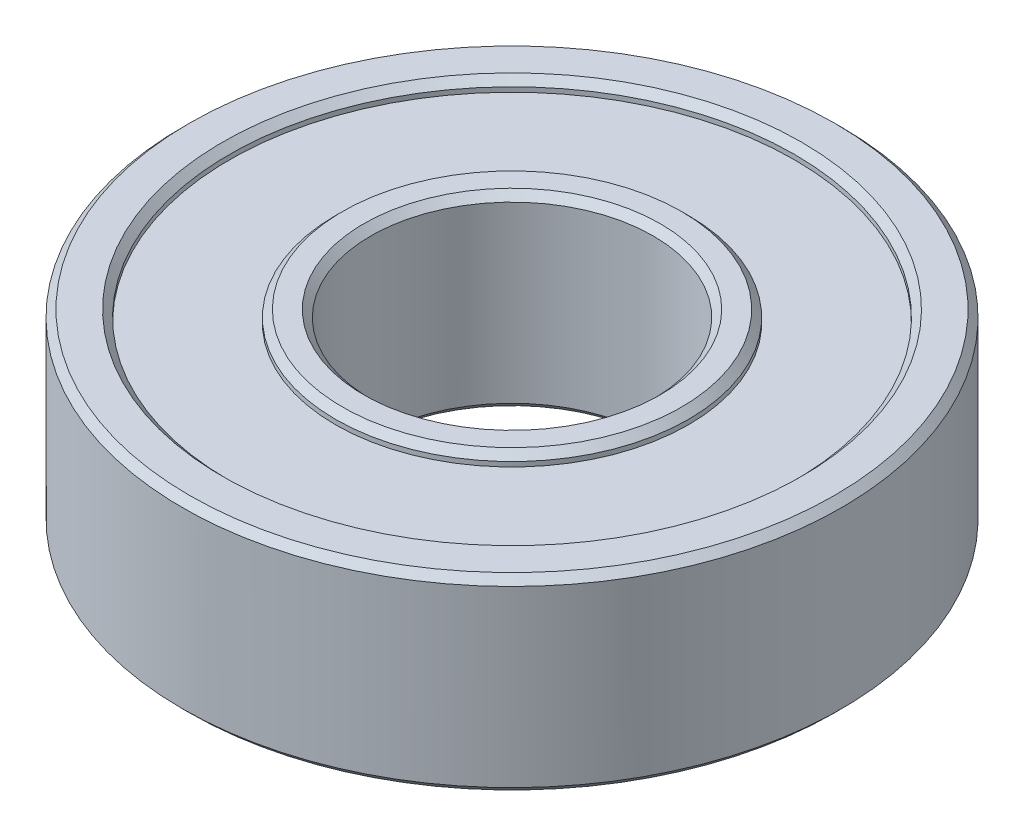
ISO-10303-21;
HEADER;
FILE_DESCRIPTION(('STEP AP214'),'2;1');
FILE_NAME('part.step','',(''),(''),'','','');
FILE_SCHEMA(('AUTOMOTIVE_DESIGN { 1 0 10303 214 1 1 1 1 }'));
ENDSEC;
DATA;
#1=APPLICATION_CONTEXT('core data for automotive mechanical design processes');
#2=APPLICATION_PROTOCOL_DEFINITION('international standard','automotive_design',2000,#1);
#3=PRODUCT_CONTEXT('',#1,'mechanical');
#4=PRODUCT('Part','Part','',(#3));
#5=PRODUCT_RELATED_PRODUCT_CATEGORY('part','',(#4));
#6=PRODUCT_DEFINITION_FORMATION('','',#4);
#7=PRODUCT_DEFINITION_CONTEXT('part definition',#1,'design');
#8=PRODUCT_DEFINITION('design','',#6,#7);
#9=PRODUCT_DEFINITION_SHAPE('','',#8);
#10=(LENGTH_UNIT() NAMED_UNIT(*) SI_UNIT(.MILLI.,.METRE.));
#11=(NAMED_UNIT(*) PLANE_ANGLE_UNIT() SI_UNIT($,.RADIAN.));
#12=(NAMED_UNIT(*) SI_UNIT($,.STERADIAN.) SOLID_ANGLE_UNIT());
#13=UNCERTAINTY_MEASURE_WITH_UNIT(LENGTH_MEASURE(1.E-05),#10,'distance_accuracy_value','');
#14=(GEOMETRIC_REPRESENTATION_CONTEXT(3) GLOBAL_UNCERTAINTY_ASSIGNED_CONTEXT((#13)) GLOBAL_UNIT_ASSIGNED_CONTEXT((#10,
#11,#12)) REPRESENTATION_CONTEXT('',''));
#15=CARTESIAN_POINT('',(0.,0.,0.));
#16=DIRECTION('',(0.,0.,1.));
#17=DIRECTION('',(1.,0.,0.));
#18=AXIS2_PLACEMENT_3D('',#15,#16,#17);
#19=CARTESIAN_POINT('',(-7.5,0.,0.));
#20=DIRECTION('',(0.,1.,0.));
#21=DIRECTION('',(0.,0.,1.));
#22=AXIS2_PLACEMENT_3D('',#19,#20,#21);
#23=PLANE('',#22);
#24=CARTESIAN_POINT('',(0.,0.,0.));
#25=DIRECTION('',(0.,1.,0.));
#26=DIRECTION('',(0.,0.,1.));
#27=AXIS2_PLACEMENT_3D('',#24,#25,#26);
#28=CIRCLE('',#27,6.3);
#29=CARTESIAN_POINT('',(0.,0.,6.3));
#30=VERTEX_POINT('',#29);
#31=EDGE_CURVE('E74',#30,#30,#28,.T.);
#32=ORIENTED_EDGE('',*,*,#31,.T.);
#33=EDGE_LOOP('',(#32));
#34=FACE_BOUND('',#33,.T.);
#35=CARTESIAN_POINT('',(0.,0.,0.));
#36=DIRECTION('',(0.,1.,0.));
#37=DIRECTION('',(0.,0.,1.));
#38=AXIS2_PLACEMENT_3D('',#35,#36,#37);
#39=CIRCLE('',#38,7.2);
#40=CARTESIAN_POINT('',(0.,0.,7.2));
#41=VERTEX_POINT('',#40);
#42=EDGE_CURVE('E77',#41,#41,#39,.F.);
#43=ORIENTED_EDGE('',*,*,#42,.T.);
#44=EDGE_LOOP('',(#43));
#45=FACE_BOUND('',#44,.T.);
#46=ADVANCED_FACE('F30',(#34,#45),#23,.F.);
#47=CARTESIAN_POINT('',(0.,0.,0.));
#48=DIRECTION('',(0.,-1.,0.));
#49=DIRECTION('',(0.,0.,-1.));
#50=AXIS2_PLACEMENT_3D('',#47,#48,#49);
#51=CYLINDRICAL_SURFACE('',#50,6.);
#52=CARTESIAN_POINT('',(0.,0.299999999999999,0.));
#53=DIRECTION('',(0.,1.,0.));
#54=DIRECTION('',(0.,0.,1.));
#55=AXIS2_PLACEMENT_3D('',#52,#53,#54);
#56=CIRCLE('',#55,6.);
#57=CARTESIAN_POINT('',(0.,0.299999999999999,6.));
#58=VERTEX_POINT('',#57);
#59=EDGE_CURVE('E80',#58,#58,#56,.F.);
#60=ORIENTED_EDGE('',*,*,#59,.T.);
#61=EDGE_LOOP('',(#60));
#62=FACE_BOUND('',#61,.T.);
#63=CARTESIAN_POINT('',(0.,7.7,0.));
#64=DIRECTION('',(0.,-1.,0.));
#65=DIRECTION('',(0.,0.,-1.));
#66=AXIS2_PLACEMENT_3D('',#63,#64,#65);
#67=CIRCLE('',#66,6.);
#68=CARTESIAN_POINT('',(0.,7.7,-6.));
#69=VERTEX_POINT('',#68);
#70=EDGE_CURVE('E83',#69,#69,#67,.F.);
#71=ORIENTED_EDGE('',*,*,#70,.T.);
#72=EDGE_LOOP('',(#71));
#73=FACE_BOUND('',#72,.T.);
#74=ADVANCED_FACE('F119',(#62,#73),#51,.F.);
#75=CARTESIAN_POINT('',(-6.,8.,0.));
#76=DIRECTION('',(0.,-1.,0.));
#77=DIRECTION('',(0.,0.,-1.));
#78=AXIS2_PLACEMENT_3D('',#75,#76,#77);
#79=PLANE('',#78);
#80=CARTESIAN_POINT('',(0.,8.,0.));
#81=DIRECTION('',(0.,-1.,0.));
#82=DIRECTION('',(0.,0.,-1.));
#83=AXIS2_PLACEMENT_3D('',#80,#81,#82);
#84=CIRCLE('',#83,6.3);
#85=CARTESIAN_POINT('',(0.,8.,-6.3));
#86=VERTEX_POINT('',#85);
#87=EDGE_CURVE('E41',#86,#86,#84,.T.);
#88=ORIENTED_EDGE('',*,*,#87,.T.);
#89=EDGE_LOOP('',(#88));
#90=FACE_BOUND('',#89,.T.);
#91=CARTESIAN_POINT('',(0.,8.,0.));
#92=DIRECTION('',(0.,-1.,0.));
#93=DIRECTION('',(0.,0.,-1.));
#94=AXIS2_PLACEMENT_3D('',#91,#92,#93);
#95=CIRCLE('',#94,7.2);
#96=CARTESIAN_POINT('',(0.,8.,-7.2));
#97=VERTEX_POINT('',#96);
#98=EDGE_CURVE('E45',#97,#97,#95,.F.);
#99=ORIENTED_EDGE('',*,*,#98,.T.);
#100=EDGE_LOOP('',(#99));
#101=FACE_BOUND('',#100,.T.);
#102=ADVANCED_FACE('F125',(#90,#101),#79,.F.);
#103=CARTESIAN_POINT('',(0.,0.,0.));
#104=DIRECTION('',(0.,-1.,0.));
#105=DIRECTION('',(0.,0.,-1.));
#106=AXIS2_PLACEMENT_3D('',#103,#104,#105);
#107=CYLINDRICAL_SURFACE('',#106,7.5);
#108=CARTESIAN_POINT('',(0.,7.7,0.));
#109=DIRECTION('',(0.,-1.,0.));
#110=DIRECTION('',(0.,0.,-1.));
#111=AXIS2_PLACEMENT_3D('',#108,#109,#110);
#112=CIRCLE('',#111,7.5);
#113=CARTESIAN_POINT('',(0.,7.7,-7.5));
#114=VERTEX_POINT('',#113);
#115=EDGE_CURVE('E37',#114,#114,#112,.T.);
#116=ORIENTED_EDGE('',*,*,#115,.T.);
#117=EDGE_LOOP('',(#116));
#118=FACE_BOUND('',#117,.T.);
#119=CARTESIAN_POINT('',(0.,7.5,0.));
#120=DIRECTION('',(0.,-1.,0.));
#121=DIRECTION('',(0.,0.,-1.));
#122=AXIS2_PLACEMENT_3D('',#119,#120,#121);
#123=CIRCLE('',#122,7.5);
#124=CARTESIAN_POINT('',(0.,7.5,-7.5));
#125=VERTEX_POINT('',#124);
#126=EDGE_CURVE('E86',#125,#125,#123,.T.);
#127=ORIENTED_EDGE('',*,*,#126,.F.);
#128=EDGE_LOOP('',(#127));
#129=FACE_BOUND('',#128,.T.);
#130=ADVANCED_FACE('F165',(#118,#129),#107,.T.);
#131=CARTESIAN_POINT('',(-7.5,7.5,0.));
#132=DIRECTION('',(0.,-1.,0.));
#133=DIRECTION('',(0.,0.,-1.));
#134=AXIS2_PLACEMENT_3D('',#131,#132,#133);
#135=PLANE('',#134);
#136=CARTESIAN_POINT('',(0.,7.5,0.));
#137=DIRECTION('',(0.,-1.,0.));
#138=DIRECTION('',(0.,0.,-1.));
#139=AXIS2_PLACEMENT_3D('',#136,#137,#138);
#140=CIRCLE('',#139,12.);
#141=CARTESIAN_POINT('',(0.,7.5,-12.));
#142=VERTEX_POINT('',#141);
#143=EDGE_CURVE('E89',#142,#142,#140,.T.);
#144=ORIENTED_EDGE('',*,*,#143,.F.);
#145=EDGE_LOOP('',(#144));
#146=FACE_BOUND('',#145,.T.);
#147=ORIENTED_EDGE('',*,*,#126,.T.);
#148=EDGE_LOOP('',(#147));
#149=FACE_BOUND('',#148,.T.);
#150=ADVANCED_FACE('F170',(#146,#149),#135,.F.);
#151=CARTESIAN_POINT('',(0.,0.,0.));
#152=DIRECTION('',(0.,-1.,0.));
#153=DIRECTION('',(0.,0.,-1.));
#154=AXIS2_PLACEMENT_3D('',#151,#152,#153);
#155=CYLINDRICAL_SURFACE('',#154,12.);
#156=CARTESIAN_POINT('',(0.,7.69999999999999,0.));
#157=DIRECTION('',(0.,-1.,0.));
#158=DIRECTION('',(0.,0.,-1.));
#159=AXIS2_PLACEMENT_3D('',#156,#157,#158);
#160=CIRCLE('',#159,12.);
#161=CARTESIAN_POINT('',(0.,7.69999999999999,-12.));
#162=VERTEX_POINT('',#161);
#163=EDGE_CURVE('E10',#162,#162,#160,.F.);
#164=ORIENTED_EDGE('',*,*,#163,.T.);
#165=EDGE_LOOP('',(#164));
#166=FACE_BOUND('',#165,.T.);
#167=ORIENTED_EDGE('',*,*,#143,.T.);
#168=EDGE_LOOP('',(#167));
#169=FACE_BOUND('',#168,.T.);
#170=ADVANCED_FACE('F175',(#166,#169),#155,.F.);
#171=CARTESIAN_POINT('',(-12.,8.,0.));
#172=DIRECTION('',(0.,-1.,0.));
#173=DIRECTION('',(0.,0.,-1.));
#174=AXIS2_PLACEMENT_3D('',#171,#172,#173);
#175=PLANE('',#174);
#176=CARTESIAN_POINT('',(0.,8.,0.));
#177=DIRECTION('',(0.,-1.,0.));
#178=DIRECTION('',(0.,0.,-1.));
#179=AXIS2_PLACEMENT_3D('',#176,#177,#178);
#180=CIRCLE('',#179,13.7);
#181=CARTESIAN_POINT('',(0.,8.,-13.7));
#182=VERTEX_POINT('',#181);
#183=EDGE_CURVE('E50',#182,#182,#180,.F.);
#184=ORIENTED_EDGE('',*,*,#183,.T.);
#185=EDGE_LOOP('',(#184));
#186=FACE_BOUND('',#185,.T.);
#187=CARTESIAN_POINT('',(0.,8.,0.));
#188=DIRECTION('',(0.,-1.,0.));
#189=DIRECTION('',(0.,0.,-1.));
#190=AXIS2_PLACEMENT_3D('',#187,#188,#189);
#191=CIRCLE('',#190,12.3);
#192=CARTESIAN_POINT('',(0.,8.,-12.3));
#193=VERTEX_POINT('',#192);
#194=EDGE_CURVE('E53',#193,#193,#191,.T.);
#195=ORIENTED_EDGE('',*,*,#194,.T.);
#196=EDGE_LOOP('',(#195));
#197=FACE_BOUND('',#196,.T.);
#198=ADVANCED_FACE('F179',(#186,#197),#175,.F.);
#199=CARTESIAN_POINT('',(0.,0.,0.));
#200=DIRECTION('',(0.,-1.,0.));
#201=DIRECTION('',(0.,0.,-1.));
#202=AXIS2_PLACEMENT_3D('',#199,#200,#201);
#203=CYLINDRICAL_SURFACE('',#202,14.);
#204=CARTESIAN_POINT('',(0.,0.30000000000001,0.));
#205=DIRECTION('',(0.,1.,0.));
#206=DIRECTION('',(0.,0.,1.));
#207=AXIS2_PLACEMENT_3D('',#204,#205,#206);
#208=CIRCLE('',#207,14.);
#209=CARTESIAN_POINT('',(0.,0.30000000000001,14.));
#210=VERTEX_POINT('',#209);
#211=EDGE_CURVE('E56',#210,#210,#208,.T.);
#212=ORIENTED_EDGE('',*,*,#211,.T.);
#213=EDGE_LOOP('',(#212));
#214=FACE_BOUND('',#213,.T.);
#215=CARTESIAN_POINT('',(0.,7.7,0.));
#216=DIRECTION('',(0.,-1.,0.));
#217=DIRECTION('',(0.,0.,-1.));
#218=AXIS2_PLACEMENT_3D('',#215,#216,#217);
#219=CIRCLE('',#218,14.);
#220=CARTESIAN_POINT('',(0.,7.7,-14.));
#221=VERTEX_POINT('',#220);
#222=EDGE_CURVE('E59',#221,#221,#219,.T.);
#223=ORIENTED_EDGE('',*,*,#222,.T.);
#224=EDGE_LOOP('',(#223));
#225=FACE_BOUND('',#224,.T.);
#226=ADVANCED_FACE('F115',(#214,#225),#203,.T.);
#227=CARTESIAN_POINT('',(-14.,0.,0.));
#228=DIRECTION('',(0.,1.,0.));
#229=DIRECTION('',(0.,0.,1.));
#230=AXIS2_PLACEMENT_3D('',#227,#228,#229);
#231=PLANE('',#230);
#232=CARTESIAN_POINT('',(0.,0.,0.));
#233=DIRECTION('',(0.,1.,0.));
#234=DIRECTION('',(0.,0.,1.));
#235=AXIS2_PLACEMENT_3D('',#232,#233,#234);
#236=CIRCLE('',#235,12.3);
#237=CARTESIAN_POINT('',(0.,0.,12.3));
#238=VERTEX_POINT('',#237);
#239=EDGE_CURVE('E62',#238,#238,#236,.T.);
#240=ORIENTED_EDGE('',*,*,#239,.T.);
#241=EDGE_LOOP('',(#240));
#242=FACE_BOUND('',#241,.T.);
#243=CARTESIAN_POINT('',(0.,0.,0.));
#244=DIRECTION('',(0.,1.,0.));
#245=DIRECTION('',(0.,0.,1.));
#246=AXIS2_PLACEMENT_3D('',#243,#244,#245);
#247=CIRCLE('',#246,13.7);
#248=CARTESIAN_POINT('',(0.,0.,13.7));
#249=VERTEX_POINT('',#248);
#250=EDGE_CURVE('E65',#249,#249,#247,.F.);
#251=ORIENTED_EDGE('',*,*,#250,.T.);
#252=EDGE_LOOP('',(#251));
#253=FACE_BOUND('',#252,.T.);
#254=ADVANCED_FACE('F109',(#242,#253),#231,.F.);
#255=CARTESIAN_POINT('',(0.,0.,0.));
#256=DIRECTION('',(0.,-1.,0.));
#257=DIRECTION('',(0.,0.,-1.));
#258=AXIS2_PLACEMENT_3D('',#255,#256,#257);
#259=CYLINDRICAL_SURFACE('',#258,12.);
#260=CARTESIAN_POINT('',(0.,0.299999999999989,0.));
#261=DIRECTION('',(0.,1.,0.));
#262=DIRECTION('',(0.,0.,1.));
#263=AXIS2_PLACEMENT_3D('',#260,#261,#262);
#264=CIRCLE('',#263,12.);
#265=CARTESIAN_POINT('',(0.,0.299999999999989,12.));
#266=VERTEX_POINT('',#265);
#267=EDGE_CURVE('E68',#266,#266,#264,.F.);
#268=ORIENTED_EDGE('',*,*,#267,.T.);
#269=EDGE_LOOP('',(#268));
#270=FACE_BOUND('',#269,.T.);
#271=CARTESIAN_POINT('',(0.,0.5,0.));
#272=DIRECTION('',(0.,-1.,0.));
#273=DIRECTION('',(0.,0.,-1.));
#274=AXIS2_PLACEMENT_3D('',#271,#272,#273);
#275=CIRCLE('',#274,12.);
#276=CARTESIAN_POINT('',(0.,0.5,-12.));
#277=VERTEX_POINT('',#276);
#278=EDGE_CURVE('E92',#277,#277,#275,.T.);
#279=ORIENTED_EDGE('',*,*,#278,.F.);
#280=EDGE_LOOP('',(#279));
#281=FACE_BOUND('',#280,.T.);
#282=ADVANCED_FACE('F104',(#270,#281),#259,.F.);
#283=CARTESIAN_POINT('',(-12.,0.5,0.));
#284=DIRECTION('',(0.,1.,0.));
#285=DIRECTION('',(0.,0.,1.));
#286=AXIS2_PLACEMENT_3D('',#283,#284,#285);
#287=PLANE('',#286);
#288=CARTESIAN_POINT('',(0.,0.5,0.));
#289=DIRECTION('',(0.,-1.,0.));
#290=DIRECTION('',(0.,0.,-1.));
#291=AXIS2_PLACEMENT_3D('',#288,#289,#290);
#292=CIRCLE('',#291,7.5);
#293=CARTESIAN_POINT('',(0.,0.5,-7.5));
#294=VERTEX_POINT('',#293);
#295=EDGE_CURVE('E95',#294,#294,#292,.T.);
#296=ORIENTED_EDGE('',*,*,#295,.F.);
#297=EDGE_LOOP('',(#296));
#298=FACE_BOUND('',#297,.T.);
#299=ORIENTED_EDGE('',*,*,#278,.T.);
#300=EDGE_LOOP('',(#299));
#301=FACE_BOUND('',#300,.T.);
#302=ADVANCED_FACE('F101',(#298,#301),#287,.F.);
#303=CARTESIAN_POINT('',(0.,0.,0.));
#304=DIRECTION('',(0.,-1.,0.));
#305=DIRECTION('',(0.,0.,-1.));
#306=AXIS2_PLACEMENT_3D('',#303,#304,#305);
#307=CYLINDRICAL_SURFACE('',#306,7.5);
#308=CARTESIAN_POINT('',(0.,0.300000000000003,0.));
#309=DIRECTION('',(0.,1.,0.));
#310=DIRECTION('',(0.,0.,1.));
#311=AXIS2_PLACEMENT_3D('',#308,#309,#310);
#312=CIRCLE('',#311,7.5);
#313=CARTESIAN_POINT('',(0.,0.300000000000003,7.5));
#314=VERTEX_POINT('',#313);
#315=EDGE_CURVE('E71',#314,#314,#312,.T.);
#316=ORIENTED_EDGE('',*,*,#315,.T.);
#317=EDGE_LOOP('',(#316));
#318=FACE_BOUND('',#317,.T.);
#319=ORIENTED_EDGE('',*,*,#295,.T.);
#320=EDGE_LOOP('',(#319));
#321=FACE_BOUND('',#320,.T.);
#322=ADVANCED_FACE('F99',(#318,#321),#307,.T.);
#323=CARTESIAN_POINT('',(0.,0.299999999999999,0.));
#324=DIRECTION('',(0.,-1.,0.));
#325=DIRECTION('',(0.,0.,-1.));
#326=AXIS2_PLACEMENT_3D('',#323,#324,#325);
#327=CONICAL_SURFACE('',#326,6.,0.78539816339745);
#328=ORIENTED_EDGE('',*,*,#31,.F.);
#329=EDGE_LOOP('',(#328));
#330=FACE_BOUND('',#329,.T.);
#331=ORIENTED_EDGE('',*,*,#59,.F.);
#332=EDGE_LOOP('',(#331));
#333=FACE_BOUND('',#332,.T.);
#334=ADVANCED_FACE('F131',(#330,#333),#327,.F.);
#335=CARTESIAN_POINT('',(0.,0.,0.));
#336=DIRECTION('',(0.,1.,0.));
#337=DIRECTION('',(0.,0.,1.));
#338=AXIS2_PLACEMENT_3D('',#335,#336,#337);
#339=CONICAL_SURFACE('',#338,7.2,0.785398163397447);
#340=ORIENTED_EDGE('',*,*,#315,.F.);
#341=EDGE_LOOP('',(#340));
#342=FACE_BOUND('',#341,.T.);
#343=ORIENTED_EDGE('',*,*,#42,.F.);
#344=EDGE_LOOP('',(#343));
#345=FACE_BOUND('',#344,.T.);
#346=ADVANCED_FACE('F134',(#342,#345),#339,.T.);
#347=CARTESIAN_POINT('',(0.,0.299999999999989,0.));
#348=DIRECTION('',(0.,-1.,0.));
#349=DIRECTION('',(0.,0.,-1.));
#350=AXIS2_PLACEMENT_3D('',#347,#348,#349);
#351=CONICAL_SURFACE('',#350,12.,0.785398163397463);
#352=ORIENTED_EDGE('',*,*,#239,.F.);
#353=EDGE_LOOP('',(#352));
#354=FACE_BOUND('',#353,.T.);
#355=ORIENTED_EDGE('',*,*,#267,.F.);
#356=EDGE_LOOP('',(#355));
#357=FACE_BOUND('',#356,.T.);
#358=ADVANCED_FACE('F138',(#354,#357),#351,.F.);
#359=CARTESIAN_POINT('',(0.,0.,0.));
#360=DIRECTION('',(0.,1.,0.));
#361=DIRECTION('',(0.,0.,1.));
#362=AXIS2_PLACEMENT_3D('',#359,#360,#361);
#363=CONICAL_SURFACE('',#362,13.7,0.785398163397437);
#364=ORIENTED_EDGE('',*,*,#211,.F.);
#365=EDGE_LOOP('',(#364));
#366=FACE_BOUND('',#365,.T.);
#367=ORIENTED_EDGE('',*,*,#250,.F.);
#368=EDGE_LOOP('',(#367));
#369=FACE_BOUND('',#368,.T.);
#370=ADVANCED_FACE('F142',(#366,#369),#363,.T.);
#371=CARTESIAN_POINT('',(0.,7.7,0.));
#372=DIRECTION('',(0.,-1.,0.));
#373=DIRECTION('',(0.,0.,-1.));
#374=AXIS2_PLACEMENT_3D('',#371,#372,#373);
#375=CONICAL_SURFACE('',#374,14.,0.785398163397451);
#376=ORIENTED_EDGE('',*,*,#183,.F.);
#377=EDGE_LOOP('',(#376));
#378=FACE_BOUND('',#377,.T.);
#379=ORIENTED_EDGE('',*,*,#222,.F.);
#380=EDGE_LOOP('',(#379));
#381=FACE_BOUND('',#380,.T.);
#382=ADVANCED_FACE('F146',(#378,#381),#375,.T.);
#383=CARTESIAN_POINT('',(0.,8.,0.));
#384=DIRECTION('',(0.,1.,0.));
#385=DIRECTION('',(0.,0.,1.));
#386=AXIS2_PLACEMENT_3D('',#383,#384,#385);
#387=CONICAL_SURFACE('',#386,6.3,0.785398163397448);
#388=ORIENTED_EDGE('',*,*,#70,.F.);
#389=EDGE_LOOP('',(#388));
#390=FACE_BOUND('',#389,.T.);
#391=ORIENTED_EDGE('',*,*,#87,.F.);
#392=EDGE_LOOP('',(#391));
#393=FACE_BOUND('',#392,.T.);
#394=ADVANCED_FACE('F150',(#390,#393),#387,.F.);
#395=CARTESIAN_POINT('',(0.,7.7,0.));
#396=DIRECTION('',(0.,-1.,0.));
#397=DIRECTION('',(0.,0.,-1.));
#398=AXIS2_PLACEMENT_3D('',#395,#396,#397);
#399=CONICAL_SURFACE('',#398,7.5,0.785398163397458);
#400=ORIENTED_EDGE('',*,*,#98,.F.);
#401=EDGE_LOOP('',(#400));
#402=FACE_BOUND('',#401,.T.);
#403=ORIENTED_EDGE('',*,*,#115,.F.);
#404=EDGE_LOOP('',(#403));
#405=FACE_BOUND('',#404,.T.);
#406=ADVANCED_FACE('F153',(#402,#405),#399,.T.);
#407=CARTESIAN_POINT('',(0.,8.,0.));
#408=DIRECTION('',(0.,1.,0.));
#409=DIRECTION('',(0.,0.,1.));
#410=AXIS2_PLACEMENT_3D('',#407,#408,#409);
#411=CONICAL_SURFACE('',#410,12.3,0.785398163397443);
#412=ORIENTED_EDGE('',*,*,#163,.F.);
#413=EDGE_LOOP('',(#412));
#414=FACE_BOUND('',#413,.T.);
#415=ORIENTED_EDGE('',*,*,#194,.F.);
#416=EDGE_LOOP('',(#415));
#417=FACE_BOUND('',#416,.T.);
#418=ADVANCED_FACE('F32',(#414,#417),#411,.F.);
#419=CLOSED_SHELL('',(#46,#74,#102,#130,#150,#170,#198,#226,#254,#282,#302,#322,#334,#346,#358,
#370,#382,#394,#406,#418));
#420=MANIFOLD_SOLID_BREP('B2',#419);
#421=ADVANCED_BREP_SHAPE_REPRESENTATION('',(#18,#420),#14);
#422=SHAPE_DEFINITION_REPRESENTATION(#9,#421);
ENDSEC;
END-ISO-10303-21;
